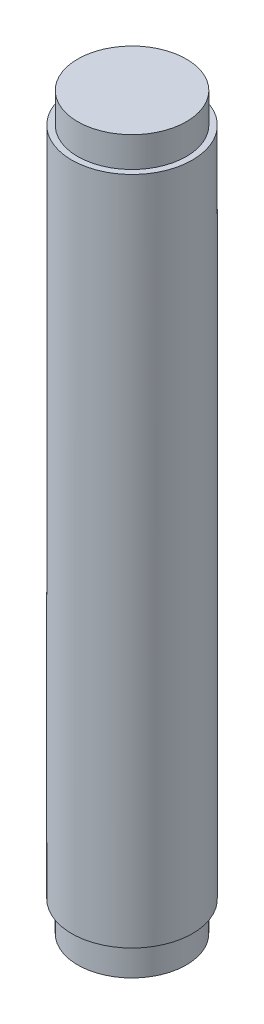
ISO-10303-21;
HEADER;
FILE_DESCRIPTION(('STEP AP214'),'2;1');
FILE_NAME('part.step','',(''),(''),'','','');
FILE_SCHEMA(('AUTOMOTIVE_DESIGN { 1 0 10303 214 1 1 1 1 }'));
ENDSEC;
DATA;
#1=APPLICATION_CONTEXT('core data for automotive mechanical design processes');
#2=APPLICATION_PROTOCOL_DEFINITION('international standard','automotive_design',2000,#1);
#3=PRODUCT_CONTEXT('',#1,'mechanical');
#4=PRODUCT('Part','Part','',(#3));
#5=PRODUCT_RELATED_PRODUCT_CATEGORY('part','',(#4));
#6=PRODUCT_DEFINITION_FORMATION('','',#4);
#7=PRODUCT_DEFINITION_CONTEXT('part definition',#1,'design');
#8=PRODUCT_DEFINITION('design','',#6,#7);
#9=PRODUCT_DEFINITION_SHAPE('','',#8);
#10=(LENGTH_UNIT() NAMED_UNIT(*) SI_UNIT(.MILLI.,.METRE.));
#11=(NAMED_UNIT(*) PLANE_ANGLE_UNIT() SI_UNIT($,.RADIAN.));
#12=(NAMED_UNIT(*) SI_UNIT($,.STERADIAN.) SOLID_ANGLE_UNIT());
#13=UNCERTAINTY_MEASURE_WITH_UNIT(LENGTH_MEASURE(1.E-05),#10,'distance_accuracy_value','');
#14=(GEOMETRIC_REPRESENTATION_CONTEXT(3) GLOBAL_UNCERTAINTY_ASSIGNED_CONTEXT((#13)) GLOBAL_UNIT_ASSIGNED_CONTEXT((#10,
#11,#12)) REPRESENTATION_CONTEXT('',''));
#15=CARTESIAN_POINT('',(0.,0.,0.));
#16=DIRECTION('',(0.,0.,1.));
#17=DIRECTION('',(1.,0.,0.));
#18=AXIS2_PLACEMENT_3D('',#15,#16,#17);
#19=CARTESIAN_POINT('',(0.,60.5,0.));
#20=DIRECTION('',(0.,-1.,0.));
#21=DIRECTION('',(0.,0.,-1.));
#22=AXIS2_PLACEMENT_3D('',#19,#20,#21);
#23=CYLINDRICAL_SURFACE('',#22,5.);
#24=CARTESIAN_POINT('',(0.,2.5,0.));
#25=DIRECTION('',(0.,-1.,0.));
#26=DIRECTION('',(0.,0.,-1.));
#27=AXIS2_PLACEMENT_3D('',#24,#25,#26);
#28=CIRCLE('',#27,5.);
#29=CARTESIAN_POINT('',(0.,2.5,-5.));
#30=VERTEX_POINT('',#29);
#31=EDGE_CURVE('E10',#30,#30,#28,.T.);
#32=ORIENTED_EDGE('',*,*,#31,.F.);
#33=EDGE_LOOP('',(#32));
#34=FACE_BOUND('',#33,.T.);
#35=CARTESIAN_POINT('',(0.,58.,0.));
#36=DIRECTION('',(0.,1.,0.));
#37=DIRECTION('',(0.,0.,1.));
#38=AXIS2_PLACEMENT_3D('',#35,#36,#37);
#39=CIRCLE('',#38,5.);
#40=CARTESIAN_POINT('',(0.,58.,5.));
#41=VERTEX_POINT('',#40);
#42=EDGE_CURVE('E46',#41,#41,#39,.T.);
#43=ORIENTED_EDGE('',*,*,#42,.F.);
#44=EDGE_LOOP('',(#43));
#45=FACE_BOUND('',#44,.T.);
#46=ADVANCED_FACE('F31',(#34,#45),#23,.T.);
#47=CARTESIAN_POINT('',(0.,2.5,0.));
#48=DIRECTION('',(0.,-1.,0.));
#49=DIRECTION('',(0.,0.,-1.));
#50=AXIS2_PLACEMENT_3D('',#47,#48,#49);
#51=PLANE('',#50);
#52=CARTESIAN_POINT('',(0.,2.5,0.));
#53=DIRECTION('',(0.,-1.,0.));
#54=DIRECTION('',(0.,0.,-1.));
#55=AXIS2_PLACEMENT_3D('',#52,#53,#54);
#56=CIRCLE('',#55,4.5);
#57=CARTESIAN_POINT('',(0.,2.5,-4.5));
#58=VERTEX_POINT('',#57);
#59=EDGE_CURVE('E37',#58,#58,#56,.T.);
#60=ORIENTED_EDGE('',*,*,#59,.F.);
#61=EDGE_LOOP('',(#60));
#62=FACE_BOUND('',#61,.T.);
#63=ORIENTED_EDGE('',*,*,#31,.T.);
#64=EDGE_LOOP('',(#63));
#65=FACE_BOUND('',#64,.T.);
#66=ADVANCED_FACE('F68',(#62,#65),#51,.T.);
#67=CARTESIAN_POINT('',(0.,2.5,0.));
#68=DIRECTION('',(0.,-1.,0.));
#69=DIRECTION('',(0.,0.,-1.));
#70=AXIS2_PLACEMENT_3D('',#67,#68,#69);
#71=CYLINDRICAL_SURFACE('',#70,4.5);
#72=ORIENTED_EDGE('',*,*,#59,.T.);
#73=EDGE_LOOP('',(#72));
#74=FACE_BOUND('',#73,.T.);
#75=CARTESIAN_POINT('',(0.,0.,0.));
#76=DIRECTION('',(0.,-1.,0.));
#77=DIRECTION('',(0.,0.,-1.));
#78=AXIS2_PLACEMENT_3D('',#75,#76,#77);
#79=CIRCLE('',#78,4.5);
#80=CARTESIAN_POINT('',(0.,0.,-4.5));
#81=VERTEX_POINT('',#80);
#82=EDGE_CURVE('E41',#81,#81,#79,.T.);
#83=ORIENTED_EDGE('',*,*,#82,.F.);
#84=EDGE_LOOP('',(#83));
#85=FACE_BOUND('',#84,.T.);
#86=ADVANCED_FACE('F73',(#74,#85),#71,.T.);
#87=CARTESIAN_POINT('',(0.,0.,0.));
#88=DIRECTION('',(0.,1.,0.));
#89=DIRECTION('',(0.,0.,1.));
#90=AXIS2_PLACEMENT_3D('',#87,#88,#89);
#91=PLANE('',#90);
#92=ORIENTED_EDGE('',*,*,#82,.T.);
#93=EDGE_LOOP('',(#92));
#94=FACE_BOUND('',#93,.T.);
#95=ADVANCED_FACE('F63',(#94),#91,.F.);
#96=CARTESIAN_POINT('',(0.,58.,0.));
#97=DIRECTION('',(0.,1.,0.));
#98=DIRECTION('',(0.,0.,1.));
#99=AXIS2_PLACEMENT_3D('',#96,#97,#98);
#100=PLANE('',#99);
#101=CARTESIAN_POINT('',(0.,58.,0.));
#102=DIRECTION('',(0.,1.,0.));
#103=DIRECTION('',(0.,0.,1.));
#104=AXIS2_PLACEMENT_3D('',#101,#102,#103);
#105=CIRCLE('',#104,4.5);
#106=CARTESIAN_POINT('',(0.,58.,4.5));
#107=VERTEX_POINT('',#106);
#108=EDGE_CURVE('E50',#107,#107,#105,.T.);
#109=ORIENTED_EDGE('',*,*,#108,.F.);
#110=EDGE_LOOP('',(#109));
#111=FACE_BOUND('',#110,.T.);
#112=ORIENTED_EDGE('',*,*,#42,.T.);
#113=EDGE_LOOP('',(#112));
#114=FACE_BOUND('',#113,.T.);
#115=ADVANCED_FACE('F60',(#111,#114),#100,.T.);
#116=CARTESIAN_POINT('',(0.,58.,0.));
#117=DIRECTION('',(0.,1.,0.));
#118=DIRECTION('',(0.,0.,1.));
#119=AXIS2_PLACEMENT_3D('',#116,#117,#118);
#120=CYLINDRICAL_SURFACE('',#119,4.5);
#121=ORIENTED_EDGE('',*,*,#108,.T.);
#122=EDGE_LOOP('',(#121));
#123=FACE_BOUND('',#122,.T.);
#124=CARTESIAN_POINT('',(0.,60.5,0.));
#125=DIRECTION('',(0.,1.,0.));
#126=DIRECTION('',(0.,0.,1.));
#127=AXIS2_PLACEMENT_3D('',#124,#125,#126);
#128=CIRCLE('',#127,4.5);
#129=CARTESIAN_POINT('',(0.,60.5,4.5));
#130=VERTEX_POINT('',#129);
#131=EDGE_CURVE('E51',#130,#130,#128,.T.);
#132=ORIENTED_EDGE('',*,*,#131,.F.);
#133=EDGE_LOOP('',(#132));
#134=FACE_BOUND('',#133,.T.);
#135=ADVANCED_FACE('F57',(#123,#134),#120,.T.);
#136=CARTESIAN_POINT('',(0.,60.5,0.));
#137=DIRECTION('',(0.,1.,0.));
#138=DIRECTION('',(0.,0.,1.));
#139=AXIS2_PLACEMENT_3D('',#136,#137,#138);
#140=PLANE('',#139);
#141=ORIENTED_EDGE('',*,*,#131,.T.);
#142=EDGE_LOOP('',(#141));
#143=FACE_BOUND('',#142,.T.);
#144=ADVANCED_FACE('F81',(#143),#140,.T.);
#145=CLOSED_SHELL('',(#46,#66,#86,#95,#115,#135,#144));
#146=MANIFOLD_SOLID_BREP('B2',#145);
#147=ADVANCED_BREP_SHAPE_REPRESENTATION('',(#18,#146),#14);
#148=SHAPE_DEFINITION_REPRESENTATION(#9,#147);
ENDSEC;
END-ISO-10303-21;
